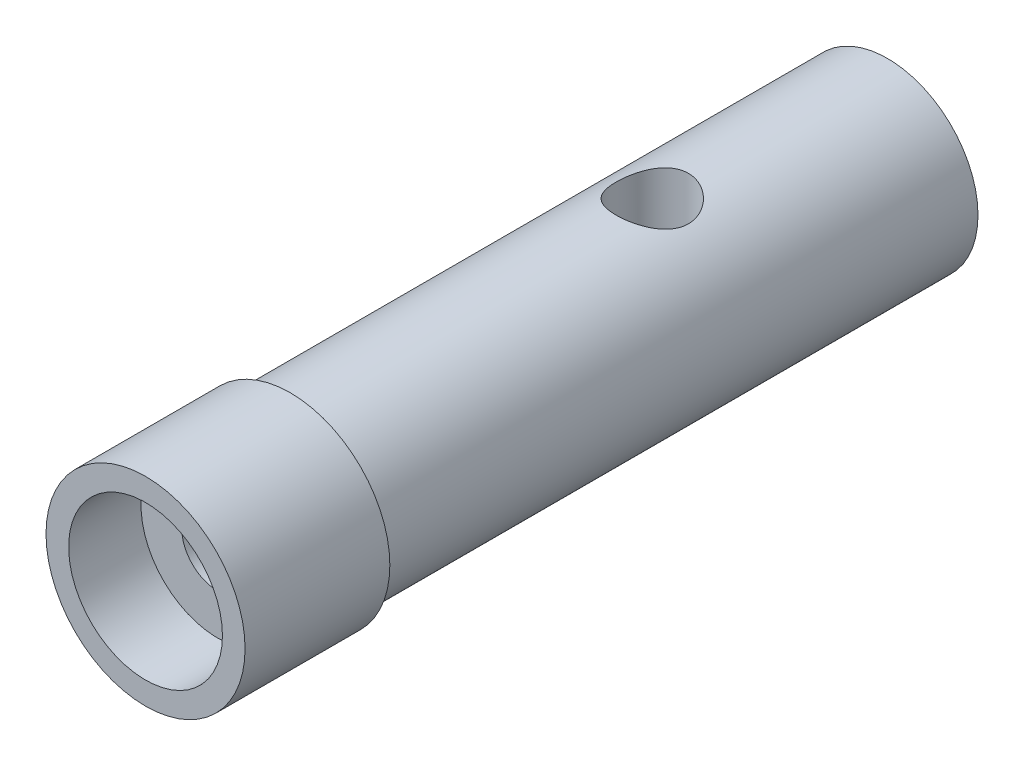
ISO-10303-21;
HEADER;
FILE_DESCRIPTION(('STEP AP214'),'2;1');
FILE_NAME('part.step','',(''),(''),'','','');
FILE_SCHEMA(('AUTOMOTIVE_DESIGN { 1 0 10303 214 1 1 1 1 }'));
ENDSEC;
DATA;
#1=APPLICATION_CONTEXT('core data for automotive mechanical design processes');
#2=APPLICATION_PROTOCOL_DEFINITION('international standard','automotive_design',2000,#1);
#3=PRODUCT_CONTEXT('',#1,'mechanical');
#4=PRODUCT('Part','Part','',(#3));
#5=PRODUCT_RELATED_PRODUCT_CATEGORY('part','',(#4));
#6=PRODUCT_DEFINITION_FORMATION('','',#4);
#7=PRODUCT_DEFINITION_CONTEXT('part definition',#1,'design');
#8=PRODUCT_DEFINITION('design','',#6,#7);
#9=PRODUCT_DEFINITION_SHAPE('','',#8);
#10=(LENGTH_UNIT() NAMED_UNIT(*) SI_UNIT(.MILLI.,.METRE.));
#11=(NAMED_UNIT(*) PLANE_ANGLE_UNIT() SI_UNIT($,.RADIAN.));
#12=(NAMED_UNIT(*) SI_UNIT($,.STERADIAN.) SOLID_ANGLE_UNIT());
#13=UNCERTAINTY_MEASURE_WITH_UNIT(LENGTH_MEASURE(1.E-05),#10,'distance_accuracy_value','');
#14=(GEOMETRIC_REPRESENTATION_CONTEXT(3) GLOBAL_UNCERTAINTY_ASSIGNED_CONTEXT((#13)) GLOBAL_UNIT_ASSIGNED_CONTEXT((#10,
#11,#12)) REPRESENTATION_CONTEXT('',''));
#15=CARTESIAN_POINT('',(0.,0.,0.));
#16=DIRECTION('',(0.,0.,1.));
#17=DIRECTION('',(1.,0.,0.));
#18=AXIS2_PLACEMENT_3D('',#15,#16,#17);
#19=CARTESIAN_POINT('',(5.5,0.,0.));
#20=DIRECTION('',(0.,0.,-1.));
#21=DIRECTION('',(-1.,0.,0.));
#22=AXIS2_PLACEMENT_3D('',#19,#20,#21);
#23=PLANE('',#22);
#24=CARTESIAN_POINT('',(0.,0.,0.));
#25=DIRECTION('',(0.,0.,1.));
#26=DIRECTION('',(1.,0.,0.));
#27=AXIS2_PLACEMENT_3D('',#24,#25,#26);
#28=CIRCLE('',#27,5.5);
#29=CARTESIAN_POINT('',(5.5,0.,0.));
#30=VERTEX_POINT('',#29);
#31=EDGE_CURVE('E42',#30,#30,#28,.T.);
#32=ORIENTED_EDGE('',*,*,#31,.F.);
#33=EDGE_LOOP('',(#32));
#34=FACE_BOUND('',#33,.T.);
#35=CARTESIAN_POINT('',(0.,0.,0.));
#36=DIRECTION('',(0.,0.,-1.));
#37=DIRECTION('',(-1.,0.,0.));
#38=AXIS2_PLACEMENT_3D('',#35,#36,#37);
#39=CIRCLE('',#38,5.);
#40=CARTESIAN_POINT('',(-5.,0.,0.));
#41=VERTEX_POINT('',#40);
#42=EDGE_CURVE('E53',#41,#41,#39,.T.);
#43=ORIENTED_EDGE('',*,*,#42,.F.);
#44=EDGE_LOOP('',(#43));
#45=FACE_BOUND('',#44,.T.);
#46=ADVANCED_FACE('F30',(#34,#45),#23,.T.);
#47=CARTESIAN_POINT('',(0.,0.,0.));
#48=DIRECTION('',(0.,0.,1.));
#49=DIRECTION('',(1.,0.,0.));
#50=AXIS2_PLACEMENT_3D('',#47,#48,#49);
#51=CYLINDRICAL_SURFACE('',#50,5.5);
#52=CARTESIAN_POINT('',(-5.5,0.,2.50000000000001));
#53=CARTESIAN_POINT('',(-5.49999900363929,0.0556786358221872,2.49999784066967));
#54=CARTESIAN_POINT('',(-5.49914576366717,0.111385724959103,2.49533412125869));
#55=CARTESIAN_POINT('',(-5.49582423750998,0.221232203424157,2.47681326698755));
#56=CARTESIAN_POINT('',(-5.4933545536127,0.27537019363304,2.46294817570933));
#57=CARTESIAN_POINT('',(-5.48707661617533,0.380473786256878,2.42646143516452));
#58=CARTESIAN_POINT('',(-5.4832695396596,0.431442131965093,2.40384748390513));
#59=CARTESIAN_POINT('',(-5.47473335749149,0.528856001692258,2.35052633440412));
#60=CARTESIAN_POINT('',(-5.47000433515661,0.575301933839529,2.31981986740591));
#61=CARTESIAN_POINT('',(-5.46008716749916,0.6628822202562,2.25081704517866));
#62=CARTESIAN_POINT('',(-5.45489486298539,0.703958113016737,2.21244707900963));
#63=CARTESIAN_POINT('',(-5.44466747605903,0.779126786705405,2.1293648229551));
#64=CARTESIAN_POINT('',(-5.43963240455629,0.813219083974897,2.08465209415543));
#65=CARTESIAN_POINT('',(-5.43024920104883,0.873693475082395,1.98974363527012));
#66=CARTESIAN_POINT('',(-5.42590643555049,0.900016566327791,1.93950973238482));
#67=CARTESIAN_POINT('',(-5.41845791638451,0.943827734749904,1.83524067483802));
#68=CARTESIAN_POINT('',(-5.41535206268372,0.961316526416387,1.78120582798749));
#69=CARTESIAN_POINT('',(-5.41077076758353,0.986775988556587,1.6714926753217));
#70=CARTESIAN_POINT('',(-5.40927792311172,0.994848332127236,1.61583870414519));
#71=CARTESIAN_POINT('',(-5.40803915716155,1.00156124368345,1.50394779634272));
#72=CARTESIAN_POINT('',(-5.40829308847025,1.00020260648323,1.44771090924198));
#73=CARTESIAN_POINT('',(-5.41050332524589,0.988174672135013,1.33698404293349));
#74=CARTESIAN_POINT('',(-5.41243856407131,0.977620588495374,1.28248106605214));
#75=CARTESIAN_POINT('',(-5.41776030636955,0.947682616700145,1.17603249081641));
#76=CARTESIAN_POINT('',(-5.42114686816159,0.928298373715953,1.1240869953241));
#77=CARTESIAN_POINT('',(-5.42901190776357,0.881136488946489,1.02388860461063));
#78=CARTESIAN_POINT('',(-5.43349645857175,0.85331195185771,0.975658278666931));
#79=CARTESIAN_POINT('',(-5.44304811005858,0.790092516870225,0.884507631527346));
#80=CARTESIAN_POINT('',(-5.44811526641734,0.754696895117933,0.841587818676873));
#81=CARTESIAN_POINT('',(-5.45835320404272,0.676716997091771,0.761610501777805));
#82=CARTESIAN_POINT('',(-5.46352440908233,0.634034086328457,0.724649155781534));
#83=CARTESIAN_POINT('',(-5.47331875218544,0.543022270346664,0.658397433259574));
#84=CARTESIAN_POINT('',(-5.4779418853578,0.494693314749086,0.629107125189357));
#85=CARTESIAN_POINT('',(-5.4861276891267,0.393663799248654,0.579016305107475));
#86=CARTESIAN_POINT('',(-5.48968916279611,0.340958390197751,0.558225365651999));
#87=CARTESIAN_POINT('',(-5.49534102735441,0.232724207231337,0.525818403753136));
#88=CARTESIAN_POINT('',(-5.49743156504548,0.177195715658035,0.514201465713032));
#89=CARTESIAN_POINT('',(-5.49988596689329,0.0657193247892513,0.500605119040426));
#90=CARTESIAN_POINT('',(-5.50027344670572,0.00978800605446796,0.498493888272947));
#91=CARTESIAN_POINT('',(-5.4993431512375,-0.101628619485484,0.503615899090733));
#92=CARTESIAN_POINT('',(-5.49802545454355,-0.157113946726542,0.510848710035858));
#93=CARTESIAN_POINT('',(-5.49384754316226,-0.265648548796381,0.534343874780926));
#94=CARTESIAN_POINT('',(-5.49099865786081,-0.318712648729162,0.5505399345914));
#95=CARTESIAN_POINT('',(-5.48407647561111,-0.421372356878309,0.591430414260958));
#96=CARTESIAN_POINT('',(-5.48000309946218,-0.470967740480479,0.616125383848838));
#97=CARTESIAN_POINT('',(-5.4710248979242,-0.565847623537474,0.673607318901453));
#98=CARTESIAN_POINT('',(-5.466111908073,-0.611082226042447,0.706475343577951));
#99=CARTESIAN_POINT('',(-5.45602144035542,-0.695441069111744,0.779260188335538));
#100=CARTESIAN_POINT('',(-5.45084393939252,-0.734564774871669,0.819177624705961));
#101=CARTESIAN_POINT('',(-5.44073019778821,-0.806088689438408,0.905523440724239));
#102=CARTESIAN_POINT('',(-5.43579776060943,-0.838399183707102,0.952026653262924));
#103=CARTESIAN_POINT('',(-5.4268075504051,-0.894749932760079,1.04987809070324));
#104=CARTESIAN_POINT('',(-5.42274974611769,-0.918790483153986,1.10122614234219));
#105=CARTESIAN_POINT('',(-5.41599772307738,-0.957789726208744,1.20707537484587));
#106=CARTESIAN_POINT('',(-5.41329719008374,-0.972790539309212,1.26156061536902));
#107=CARTESIAN_POINT('',(-5.40955063272695,-0.993415200892781,1.37233149431553));
#108=CARTESIAN_POINT('',(-5.40850443405679,-0.999040037268158,1.42861694242446));
#109=CARTESIAN_POINT('',(-5.40819346941308,-1.00072156831593,1.54049268773182));
#110=CARTESIAN_POINT('',(-5.40890237272057,-0.996919685006175,1.59608083571927));
#111=CARTESIAN_POINT('',(-5.41196354373513,-0.980164234564086,1.70581181900871));
#112=CARTESIAN_POINT('',(-5.41431580298504,-0.967210714528601,1.75995466174714));
#113=CARTESIAN_POINT('',(-5.42038786040456,-0.932577835792395,1.86518809869769));
#114=CARTESIAN_POINT('',(-5.42410539649873,-0.910912905096173,1.91628358011172));
#115=CARTESIAN_POINT('',(-5.43249088757423,-0.859487368324126,2.01413722358237));
#116=CARTESIAN_POINT('',(-5.4371589041147,-0.829726237845046,2.0608951044228));
#117=CARTESIAN_POINT('',(-5.44700162325733,-0.762457718314005,2.14945643729782));
#118=CARTESIAN_POINT('',(-5.45218253915553,-0.724847077765507,2.19118078493539));
#119=CARTESIAN_POINT('',(-5.46241996034325,-0.643163257116829,2.2677735405061));
#120=CARTESIAN_POINT('',(-5.46747643675957,-0.599088593400475,2.30264037019613));
#121=CARTESIAN_POINT('',(-5.47694487148596,-0.505285594823157,2.36480014856175));
#122=CARTESIAN_POINT('',(-5.48135106586716,-0.455512924895255,2.39202709259008));
#123=CARTESIAN_POINT('',(-5.48896630496673,-0.352036952543178,2.43768960803704));
#124=CARTESIAN_POINT('',(-5.49217649292367,-0.29833746274334,2.45613357963917));
#125=CARTESIAN_POINT('',(-5.49637035188244,-0.203720874729207,2.47988771515111));
#126=CARTESIAN_POINT('',(-5.49772390136792,-0.163362713638248,2.48741716648019));
#127=CARTESIAN_POINT('',(-5.49953908216522,-0.0820081710661034,2.49747404689746));
#128=CARTESIAN_POINT('',(-5.50000073389999,-0.0410118042204174,2.5000015905209));
#129=CARTESIAN_POINT('',(-5.5,0.,2.50000000000001));
#130=B_SPLINE_CURVE_WITH_KNOTS('',3,(#52,#53,#54,#55,#56,#57,#58,#59,#60,#61,#62,#63,#64,#65,
#66,#67,#68,#69,#70,#71,#72,#73,#74,#75,#76,#77,#78,#79,#80,#81,#82,#83,#84,#85,#86,#87,#88,#89,
#90,#91,#92,#93,#94,#95,#96,#97,#98,#99,#100,#101,#102,#103,#104,#105,#106,#107,#108,#109,#110,
#111,#112,#113,#114,#115,#116,#117,#118,#119,#120,#121,#122,#123,#124,#125,#126,#127,#128,#129),
.UNSPECIFIED.,.T.,.F.,(4,2,2,2,2,2,2,2,2,2,2,2,2,2,2,2,2,2,2,2,2,2,2,2,2,2,2,2,2,2,2,2,2,2,2,2,
2,2,4),(0.,0.166885945776168,0.333916386036299,0.500800191433378,0.667668922300759,
0.836225072984436,1.0047928933154,1.17460976101827,1.34441289227867,1.51236510586324,
1.68030316512103,1.8461668364545,2.01203717339438,2.17884653230815,2.3456718466063,
2.51496605220939,2.68426176852326,2.85374763511909,3.0232165843073,3.19032800498686,
3.35743172425403,3.52331571642719,3.68921044037115,3.85682113397838,4.02444648808066,
4.19415753065235,4.36386250626243,4.53277050538084,4.70166070651807,4.86803254865192,
5.03440353459662,5.20050010129487,5.36660742888459,5.53505557265026,5.70354243914739,
5.87344302271471,6.0431807824909,6.16610855114787,6.2890335049339),.UNSPECIFIED.);
#131=CARTESIAN_POINT('',(-5.5,0.,2.50000000000001));
#132=VERTEX_POINT('',#131);
#133=EDGE_CURVE('E70',#132,#132,#130,.T.);
#134=ORIENTED_EDGE('',*,*,#133,.F.);
#135=EDGE_LOOP('',(#134));
#136=FACE_BOUND('',#135,.T.);
#137=ORIENTED_EDGE('',*,*,#31,.T.);
#138=EDGE_LOOP('',(#137));
#139=FACE_BOUND('',#138,.T.);
#140=CARTESIAN_POINT('',(0.,0.,8.));
#141=DIRECTION('',(0.,0.,1.));
#142=DIRECTION('',(1.,0.,0.));
#143=AXIS2_PLACEMENT_3D('',#140,#141,#142);
#144=CIRCLE('',#143,5.5);
#145=CARTESIAN_POINT('',(5.5,0.,8.));
#146=VERTEX_POINT('',#145);
#147=EDGE_CURVE('E46',#146,#146,#144,.T.);
#148=ORIENTED_EDGE('',*,*,#147,.F.);
#149=EDGE_LOOP('',(#148));
#150=FACE_BOUND('',#149,.T.);
#151=ADVANCED_FACE('F32',(#136,#139,#150),#51,.T.);
#152=CARTESIAN_POINT('',(0.,0.,8.));
#153=DIRECTION('',(0.,0.,1.));
#154=DIRECTION('',(1.,0.,0.));
#155=AXIS2_PLACEMENT_3D('',#152,#153,#154);
#156=PLANE('',#155);
#157=CARTESIAN_POINT('',(0.,0.,8.));
#158=DIRECTION('',(0.,0.,1.));
#159=DIRECTION('',(1.,0.,0.));
#160=AXIS2_PLACEMENT_3D('',#157,#158,#159);
#161=CIRCLE('',#160,4.24999999999999);
#162=CARTESIAN_POINT('',(4.24999999999999,0.,8.));
#163=VERTEX_POINT('',#162);
#164=EDGE_CURVE('E67',#163,#163,#161,.T.);
#165=ORIENTED_EDGE('',*,*,#164,.F.);
#166=EDGE_LOOP('',(#165));
#167=FACE_BOUND('',#166,.T.);
#168=ORIENTED_EDGE('',*,*,#147,.T.);
#169=EDGE_LOOP('',(#168));
#170=FACE_BOUND('',#169,.T.);
#171=ADVANCED_FACE('F114',(#167,#170),#156,.T.);
#172=CARTESIAN_POINT('',(0.,0.,-33.));
#173=DIRECTION('',(0.,0.,1.));
#174=DIRECTION('',(1.,0.,0.));
#175=AXIS2_PLACEMENT_3D('',#172,#173,#174);
#176=CYLINDRICAL_SURFACE('',#175,5.);
#177=CARTESIAN_POINT('',(0.,5.,-18.));
#178=CARTESIAN_POINT('',(-0.107493005442891,4.99999271227085,-18.0000098518237));
#179=CARTESIAN_POINT('',(-0.215172564090674,4.99649294306932,-18.0087177520884));
#180=CARTESIAN_POINT('',(-0.427496480417896,4.98283453100641,-18.0432477035212));
#181=CARTESIAN_POINT('',(-0.532131777561249,4.97265778698877,-18.0691162790861));
#182=CARTESIAN_POINT('',(-0.734953922727403,4.94674209213118,-18.1368760780588));
#183=CARTESIAN_POINT('',(-0.833160661616959,4.93102136364072,-18.1787148462167));
#184=CARTESIAN_POINT('',(-1.02107197032837,4.89556610796078,-18.2770191733265));
#185=CARTESIAN_POINT('',(-1.11077947675099,4.87583297458057,-18.3334796549189));
#186=CARTESIAN_POINT('',(-1.28350100757039,4.83330886170419,-18.4622354985609));
#187=CARTESIAN_POINT('',(-1.36606227255021,4.8104229692919,-18.5351066562403));
#188=CARTESIAN_POINT('',(-1.51817500478472,4.76460576906194,-18.6934000034768));
#189=CARTESIAN_POINT('',(-1.58772010713353,4.74167444453792,-18.7788282972117));
#190=CARTESIAN_POINT('',(-1.71487456729288,4.69722791797136,-18.9644280702423));
#191=CARTESIAN_POINT('',(-1.77181498119547,4.67582115964951,-19.0650864860232));
#192=CARTESIAN_POINT('',(-1.86775471903715,4.63833647186792,-19.27553639842));
#193=CARTESIAN_POINT('',(-1.90676256428584,4.62225601244176,-19.3853235278484));
#194=CARTESIAN_POINT('',(-1.96389882339587,4.59826357660818,-19.6057123335921));
#195=CARTESIAN_POINT('',(-1.98289396580565,4.59001420355605,-19.7160512355762));
#196=CARTESIAN_POINT('',(-2.00217296164003,4.58164004049144,-19.9386349983073));
#197=CARTESIAN_POINT('',(-2.00246601631322,4.58151125522768,-20.050878894625));
#198=CARTESIAN_POINT('',(-1.98498936750455,4.58910500279994,-20.265756671458));
#199=CARTESIAN_POINT('',(-1.96847531430514,4.5962817503845,-20.368515714409));
#200=CARTESIAN_POINT('',(-1.91994688029782,4.61676187607836,-20.5696595560067));
#201=CARTESIAN_POINT('',(-1.88792979480463,4.63006632321673,-20.6680435881103));
#202=CARTESIAN_POINT('',(-1.80869473255107,4.6615948508853,-20.860017836196));
#203=CARTESIAN_POINT('',(-1.76117986231532,4.67991379280788,-20.9534692390547));
#204=CARTESIAN_POINT('',(-1.65250646073221,4.7193811638989,-21.1314158163616));
#205=CARTESIAN_POINT('',(-1.59134280510085,4.74053065456849,-21.2159076094028));
#206=CARTESIAN_POINT('',(-1.45155059945444,4.78526736742271,-21.380409728802));
#207=CARTESIAN_POINT('',(-1.37193746297064,4.80891664976151,-21.459568729446));
#208=CARTESIAN_POINT('',(-1.20031442743019,4.85459824958282,-21.603684478002));
#209=CARTESIAN_POINT('',(-1.10830206533443,4.87663024445325,-21.6686383974103));
#210=CARTESIAN_POINT('',(-0.912077652605842,4.91714681264548,-21.7836174474158));
#211=CARTESIAN_POINT('',(-0.807660491346477,4.93555270095415,-21.8333222811971));
#212=CARTESIAN_POINT('',(-0.591023765482882,4.96614828328759,-21.9141678610781));
#213=CARTESIAN_POINT('',(-0.478808196849675,4.97834113462382,-21.9453180375574));
#214=CARTESIAN_POINT('',(-0.256895887607821,4.99456139506911,-21.9864482954197));
#215=CARTESIAN_POINT('',(-0.147443293985536,4.99902945833514,-21.9975724542536));
#216=CARTESIAN_POINT('',(0.0718453098078163,5.00068478510631,-22.0017131005286));
#217=CARTESIAN_POINT('',(0.181681213223923,4.99787393582291,-21.9947342815475));
#218=CARTESIAN_POINT('',(0.393432739121987,4.98557567063753,-21.963708247448));
#219=CARTESIAN_POINT('',(0.495482491775474,4.97639391345523,-21.940442019649));
#220=CARTESIAN_POINT('',(0.694135428060781,4.952594414055,-21.8785642916902));
#221=CARTESIAN_POINT('',(0.790737910224845,4.9379759735653,-21.8399508203313));
#222=CARTESIAN_POINT('',(0.979078785816703,4.90416594770812,-21.7472150603201));
#223=CARTESIAN_POINT('',(1.07057802275541,4.88484815979803,-21.6926545279569));
#224=CARTESIAN_POINT('',(1.24344359124656,4.84373364745525,-21.5700596760944));
#225=CARTESIAN_POINT('',(1.32480584076113,4.8219359311027,-21.5020199570774));
#226=CARTESIAN_POINT('',(1.48072304302882,4.77645117638112,-21.3491299870504));
#227=CARTESIAN_POINT('',(1.55447393380607,4.75273441425052,-21.2634664584938));
#228=CARTESIAN_POINT('',(1.68675119741371,4.70741672917132,-21.0805599169906));
#229=CARTESIAN_POINT('',(1.74527506133751,4.68581615526511,-20.9833149996601));
#230=CARTESIAN_POINT('',(1.84580750193163,4.64714299907708,-20.7785383054059));
#231=CARTESIAN_POINT('',(1.88765059453445,4.63011630884788,-20.6709160007877));
#232=CARTESIAN_POINT('',(1.95229621970531,4.60323673477931,-20.4492663482849));
#233=CARTESIAN_POINT('',(1.97511280526932,4.59337855695998,-20.3352437941876));
#234=CARTESIAN_POINT('',(1.9997156172784,4.58271759299926,-20.1128720982255));
#235=CARTESIAN_POINT('',(2.00289708230287,4.58131421008171,-20.0047051604067));
#236=CARTESIAN_POINT('',(1.99180315927753,4.58614836033098,-19.7894551422867));
#237=CARTESIAN_POINT('',(1.97752998791378,4.59238492324793,-19.6823719260974));
#238=CARTESIAN_POINT('',(1.93307136615365,4.6112664907902,-19.476667810145));
#239=CARTESIAN_POINT('',(1.90353749357098,4.62364831827449,-19.377879725567));
#240=CARTESIAN_POINT('',(1.83000544849102,4.65324001232696,-19.1866213703865));
#241=CARTESIAN_POINT('',(1.78600328139382,4.67045121206007,-19.0941528531002));
#242=CARTESIAN_POINT('',(1.68187276275973,4.70898609604491,-18.9123903807292));
#243=CARTESIAN_POINT('',(1.62096533515949,4.73048882313242,-18.8235813298695));
#244=CARTESIAN_POINT('',(1.4858921192715,4.77463804372237,-18.6570066827962));
#245=CARTESIAN_POINT('',(1.41172233481812,4.79728488048406,-18.5792444278717));
#246=CARTESIAN_POINT('',(1.24650550627247,4.84293567087394,-18.4317971467364));
#247=CARTESIAN_POINT('',(1.15467600114614,4.86586757962185,-18.3629626931019));
#248=CARTESIAN_POINT('',(0.959900320285782,4.90800406713717,-18.2416629573784));
#249=CARTESIAN_POINT('',(0.85694900454724,4.92720691092906,-18.1892052878475));
#250=CARTESIAN_POINT('',(0.644738062495204,4.95939714815861,-18.1033777848097));
#251=CARTESIAN_POINT('',(0.535631618219697,4.97249363055028,-18.0696706764397));
#252=CARTESIAN_POINT('',(0.312876546281221,4.99144306209366,-18.0213608790457));
#253=CARTESIAN_POINT('',(0.199243525858913,4.99731899495638,-18.0066975632561));
#254=CARTESIAN_POINT('',(0.0569122978909295,4.99975899504136,-18.0006046190217));
#255=CARTESIAN_POINT('',(0.0284626887407583,5.00000192969176,-17.9999973913708));
#256=CARTESIAN_POINT('',(0.,5.,-18.));
#257=B_SPLINE_CURVE_WITH_KNOTS('',3,(#177,#178,#179,#180,#181,#182,#183,#184,#185,#186,#187,
#188,#189,#190,#191,#192,#193,#194,#195,#196,#197,#198,#199,#200,#201,#202,#203,#204,#205,#206,
#207,#208,#209,#210,#211,#212,#213,#214,#215,#216,#217,#218,#219,#220,#221,#222,#223,#224,#225,
#226,#227,#228,#229,#230,#231,#232,#233,#234,#235,#236,#237,#238,#239,#240,#241,#242,#243,#244,
#245,#246,#247,#248,#249,#250,#251,#252,#253,#254,#255,#256),.UNSPECIFIED.,.T.,.F.,(4,2,2,2,2,2,
2,2,2,2,2,2,2,2,2,2,2,2,2,2,2,2,2,2,2,2,2,2,2,2,2,2,2,2,2,2,2,2,2,4),(0.,0.322402987893071,
0.645683636007935,0.967911457471581,1.29002753567984,1.62597381700397,1.96208394934412,
2.31315258819217,2.66405423118268,2.99904105308829,3.33386306340488,3.64538328401373,
3.95695787256048,4.27489126298816,4.59294421938184,4.93558349186557,5.27829092839734,
5.62776913162807,5.97706956113791,6.30569184528008,6.63422893570083,6.94800455564366,
7.26182048993797,7.58523513398263,7.9087795949897,8.25368474624414,8.59864669043749,
8.94695045140828,9.29499672645935,9.61799673392749,9.94095572563047,10.2511431854877,
10.5614163580516,10.8894546805669,11.2175920134839,11.5670042353384,11.9165786364053,
12.2596430101332,12.6016125240434,12.686980458968),.UNSPECIFIED.);
#258=CARTESIAN_POINT('',(0.,5.,-18.));
#259=VERTEX_POINT('',#258);
#260=EDGE_CURVE('E10',#259,#259,#257,.T.);
#261=ORIENTED_EDGE('',*,*,#260,.T.);
#262=EDGE_LOOP('',(#261));
#263=FACE_BOUND('',#262,.T.);
#264=CARTESIAN_POINT('',(0.,0.,-33.));
#265=DIRECTION('',(0.,0.,-1.));
#266=DIRECTION('',(-1.,0.,0.));
#267=AXIS2_PLACEMENT_3D('',#264,#265,#266);
#268=CIRCLE('',#267,5.);
#269=CARTESIAN_POINT('',(-5.,0.,-33.));
#270=VERTEX_POINT('',#269);
#271=EDGE_CURVE('E50',#270,#270,#268,.T.);
#272=ORIENTED_EDGE('',*,*,#271,.F.);
#273=EDGE_LOOP('',(#272));
#274=FACE_BOUND('',#273,.T.);
#275=ORIENTED_EDGE('',*,*,#42,.T.);
#276=EDGE_LOOP('',(#275));
#277=FACE_BOUND('',#276,.T.);
#278=ADVANCED_FACE('F109',(#263,#274,#277),#176,.T.);
#279=CARTESIAN_POINT('',(0.,0.,-33.));
#280=DIRECTION('',(0.,0.,-1.));
#281=DIRECTION('',(-1.,0.,0.));
#282=AXIS2_PLACEMENT_3D('',#279,#280,#281);
#283=PLANE('',#282);
#284=CARTESIAN_POINT('',(0.,0.,-33.));
#285=DIRECTION('',(0.,0.,-1.));
#286=DIRECTION('',(-1.,0.,0.));
#287=AXIS2_PLACEMENT_3D('',#284,#285,#286);
#288=CIRCLE('',#287,2.);
#289=CARTESIAN_POINT('',(-2.,0.,-33.));
#290=VERTEX_POINT('',#289);
#291=EDGE_CURVE('E137',#290,#290,#288,.T.);
#292=ORIENTED_EDGE('',*,*,#291,.F.);
#293=EDGE_LOOP('',(#292));
#294=FACE_BOUND('',#293,.T.);
#295=ORIENTED_EDGE('',*,*,#271,.T.);
#296=EDGE_LOOP('',(#295));
#297=FACE_BOUND('',#296,.T.);
#298=ADVANCED_FACE('F106',(#294,#297),#283,.T.);
#299=CARTESIAN_POINT('',(0.,0.,-6.));
#300=DIRECTION('',(0.,0.,-1.));
#301=DIRECTION('',(-1.,0.,0.));
#302=AXIS2_PLACEMENT_3D('',#299,#300,#301);
#303=PLANE('',#302);
#304=CARTESIAN_POINT('',(0.,0.,-6.));
#305=DIRECTION('',(0.,0.,1.));
#306=DIRECTION('',(1.,0.,0.));
#307=AXIS2_PLACEMENT_3D('',#304,#305,#306);
#308=CIRCLE('',#307,2.);
#309=CARTESIAN_POINT('',(2.,0.,-6.));
#310=VERTEX_POINT('',#309);
#311=EDGE_CURVE('E56',#310,#310,#308,.T.);
#312=ORIENTED_EDGE('',*,*,#311,.T.);
#313=EDGE_LOOP('',(#312));
#314=FACE_BOUND('',#313,.T.);
#315=ADVANCED_FACE('F102',(#314),#303,.F.);
#316=CARTESIAN_POINT('',(0.,0.,8.));
#317=DIRECTION('',(0.,0.,1.));
#318=DIRECTION('',(1.,0.,0.));
#319=AXIS2_PLACEMENT_3D('',#316,#317,#318);
#320=CYLINDRICAL_SURFACE('',#319,2.);
#321=CARTESIAN_POINT('',(-2.,0.,2.50000000000001));
#322=CARTESIAN_POINT('',(-1.99999713404151,0.052571962952987,2.49999669768051));
#323=CARTESIAN_POINT('',(-1.99790491019517,0.105206599698034,2.49582992687834));
#324=CARTESIAN_POINT('',(-1.98974156037396,0.208920235268427,2.4793471196591));
#325=CARTESIAN_POINT('',(-1.98366287828983,0.259996086713506,2.46701560700236));
#326=CARTESIAN_POINT('',(-1.96816279403311,0.358933544880578,2.43480619138322));
#327=CARTESIAN_POINT('',(-1.9587543917752,0.406806802939184,2.414957615752));
#328=CARTESIAN_POINT('',(-1.93745776515778,0.49847261680657,2.36842937863507));
#329=CARTESIAN_POINT('',(-1.9255697363353,0.542265493990056,2.34175025575116));
#330=CARTESIAN_POINT('',(-1.89956258258056,0.627507817761926,2.28048275051471));
#331=CARTESIAN_POINT('',(-1.88535199127535,0.668655211122119,2.24551352076037));
#332=CARTESIAN_POINT('',(-1.85659970246744,0.744779444866985,2.16947852075298));
#333=CARTESIAN_POINT('',(-1.84205776209034,0.779751583106775,2.12840814822757));
#334=CARTESIAN_POINT('',(-1.81298951197346,0.845252000450288,2.03751665047663));
#335=CARTESIAN_POINT('',(-1.79855186970131,0.875225335551647,1.9872639016541));
#336=CARTESIAN_POINT('',(-1.7728597877232,0.926168226890707,1.88163266401379));
#337=CARTESIAN_POINT('',(-1.76160307606989,0.947144214966345,1.82625787127726));
#338=CARTESIAN_POINT('',(-1.74457867037808,0.978132442188601,1.71533489457808));
#339=CARTESIAN_POINT('',(-1.73852271583713,0.988725857080454,1.65999554793261));
#340=CARTESIAN_POINT('',(-1.73181889948527,1.00042699330886,1.54802116222053));
#341=CARTESIAN_POINT('',(-1.73116569343287,1.00154408837309,1.49138745912885));
#342=CARTESIAN_POINT('',(-1.73510930257247,0.994687287172307,1.38571397568463));
#343=CARTESIAN_POINT('',(-1.73908763662012,0.987784559536835,1.33657596877695));
#344=CARTESIAN_POINT('',(-1.75076228733849,0.966939849056945,1.24027809062696));
#345=CARTESIAN_POINT('',(-1.75845978831775,0.952995623897665,1.19311885469468));
#346=CARTESIAN_POINT('',(-1.7768747641274,0.918209780386017,1.10077086743434));
#347=CARTESIAN_POINT('',(-1.78765840663998,0.897215067116008,1.05565360121421));
#348=CARTESIAN_POINT('',(-1.81103404281403,0.849041687668015,0.969365707409988));
#349=CARTESIAN_POINT('',(-1.8236268478019,0.82186024381248,0.928196864399907));
#350=CARTESIAN_POINT('',(-1.85113157903285,0.758066054912801,0.845478747256769));
#351=CARTESIAN_POINT('',(-1.86613510236745,0.720694458369294,0.804543126423837));
#352=CARTESIAN_POINT('',(-1.89547623300407,0.639555578741385,0.729264581409091));
#353=CARTESIAN_POINT('',(-1.909813519588,0.595785256574297,0.694924807966109));
#354=CARTESIAN_POINT('',(-1.93701987282963,0.500516505831859,0.632314338970264));
#355=CARTESIAN_POINT('',(-1.94978984162007,0.448753591599418,0.60439952755425));
#356=CARTESIAN_POINT('',(-1.97157881121242,0.340466215488805,0.55790297095698));
#357=CARTESIAN_POINT('',(-1.98060078943552,0.283945576265284,0.539313814984821));
#358=CARTESIAN_POINT('',(-1.99324333741436,0.172766491660708,0.513524596283312));
#359=CARTESIAN_POINT('',(-1.99724938301311,0.11834153054833,0.505508764253209));
#360=CARTESIAN_POINT('',(-2.00073013459102,0.00877959994935761,0.498535268865497));
#361=CARTESIAN_POINT('',(-2.00020698721312,-0.0463570198698982,0.499573314360508));
#362=CARTESIAN_POINT('',(-1.99491192253441,-0.151232971985992,0.51020668841874));
#363=CARTESIAN_POINT('',(-1.99047245688189,-0.201059408049953,0.519132532730017));
#364=CARTESIAN_POINT('',(-1.97822171314819,-0.298406892301917,0.544238071895072));
#365=CARTESIAN_POINT('',(-1.97041006334332,-0.345927685690997,0.560418566453345));
#366=CARTESIAN_POINT('',(-1.95184251413669,-0.438888608449667,0.599998466433158));
#367=CARTESIAN_POINT('',(-1.94100881769939,-0.484230397006156,0.623591050116799));
#368=CARTESIAN_POINT('',(-1.91743974317109,-0.570461361698924,0.677107535646028));
#369=CARTESIAN_POINT('',(-1.90470355565785,-0.611348629775286,0.707034134593418));
#370=CARTESIAN_POINT('',(-1.87708221337464,-0.691767689290658,0.77576042533286));
#371=CARTESIAN_POINT('',(-1.86210884848441,-0.730772077824644,0.815142868453552));
#372=CARTESIAN_POINT('',(-1.83262391603874,-0.801856321113246,0.899925151269292));
#373=CARTESIAN_POINT('',(-1.81811267381526,-0.833931385690849,0.945329118816362));
#374=CARTESIAN_POINT('',(-1.79051192226067,-0.891707914497705,1.0436436542003));
#375=CARTESIAN_POINT('',(-1.77752529663471,-0.917025495878647,1.09681126620858));
#376=CARTESIAN_POINT('',(-1.75574072368125,-0.958082826013814,1.20751006769251));
#377=CARTESIAN_POINT('',(-1.74693738240617,-0.973834915887581,1.26503552650118));
#378=CARTESIAN_POINT('',(-1.73561501008666,-0.993861687449691,1.37691022286144));
#379=CARTESIAN_POINT('',(-1.7325738346049,-0.999092996400878,1.43103425342903));
#380=CARTESIAN_POINT('',(-1.73165354646174,-1.0006891543808,1.53944706717072));
#381=CARTESIAN_POINT('',(-1.73377219627552,-0.997057846624412,1.59373576873943));
#382=CARTESIAN_POINT('',(-1.74237862050024,-0.981926125592277,1.69548350153201));
#383=CARTESIAN_POINT('',(-1.74843094482393,-0.971208314342813,1.7431004701444));
#384=CARTESIAN_POINT('',(-1.76371016187916,-0.943175358224659,1.8358081194247));
#385=CARTESIAN_POINT('',(-1.77293807569675,-0.925858091159825,1.88089798209197));
#386=CARTESIAN_POINT('',(-1.79428530364527,-0.883815745300698,1.97062485098661));
#387=CARTESIAN_POINT('',(-1.8065572239619,-0.858671137816473,2.0150279018297));
#388=CARTESIAN_POINT('',(-1.83235331634589,-0.802150971636649,2.09927453618059));
#389=CARTESIAN_POINT('',(-1.84587813794521,-0.770772171238663,2.13911573051849));
#390=CARTESIAN_POINT('',(-1.87462323159312,-0.698203326664656,2.21814198235762));
#391=CARTESIAN_POINT('',(-1.88984983311468,-0.656284423010186,2.25665910236193));
#392=CARTESIAN_POINT('',(-1.91877752255087,-0.566154806220294,2.32626298342364));
#393=CARTESIAN_POINT('',(-1.93247778608039,-0.517940723256799,2.3573457394263));
#394=CARTESIAN_POINT('',(-1.95698009585103,-0.41593159681996,2.41123636276221));
#395=CARTESIAN_POINT('',(-1.96776096562908,-0.362099503934627,2.43398416941144));
#396=CARTESIAN_POINT('',(-1.98501341363465,-0.250742101294202,2.46980816791896));
#397=CARTESIAN_POINT('',(-1.99149723372932,-0.193227799623176,2.48291184682959));
#398=CARTESIAN_POINT('',(-1.99695461909663,-0.112601946483391,2.49389741107586));
#399=CARTESIAN_POINT('',(-1.99809365339201,-0.0901618794395047,2.49618264086363));
#400=CARTESIAN_POINT('',(-1.99961696977865,-0.0451517318071607,2.49923466551682));
#401=CARTESIAN_POINT('',(-2.00000123103763,-0.0225816476473829,2.50000141847121));
#402=CARTESIAN_POINT('',(-2.,0.,2.50000000000001));
#403=B_SPLINE_CURVE_WITH_KNOTS('',3,(#321,#322,#323,#324,#325,#326,#327,#328,#329,#330,#331,
#332,#333,#334,#335,#336,#337,#338,#339,#340,#341,#342,#343,#344,#345,#346,#347,#348,#349,#350,
#351,#352,#353,#354,#355,#356,#357,#358,#359,#360,#361,#362,#363,#364,#365,#366,#367,#368,#369,
#370,#371,#372,#373,#374,#375,#376,#377,#378,#379,#380,#381,#382,#383,#384,#385,#386,#387,#388,
#389,#390,#391,#392,#393,#394,#395,#396,#397,#398,#399,#400,#401,#402),.UNSPECIFIED.,.T.,.F.,(4,
2,2,2,2,2,2,2,2,2,2,2,2,2,2,2,2,2,2,2,2,2,2,2,2,2,2,2,2,2,2,2,2,2,2,2,2,2,2,2,4),(0.,
0.157624257420294,0.315548149709201,0.472862155492303,0.630163760581574,0.796981758718097,
0.963926237654046,1.14381726430754,1.32357947898283,1.49258012140231,1.66141357329022,
1.81005712409323,1.95874803925681,2.1109024016849,2.26312521260224,2.43464941333881,
2.60625534598689,2.78583022214444,2.96526216912283,3.12983290471349,3.2943256451148,
3.44606906506126,3.59782921630936,3.75392856027903,3.91009450748344,4.08159610644424,
4.25321588615437,4.43314682159679,4.61284511940783,4.77529307498379,4.93767059860012,
5.08457930244189,5.23153528783684,5.38836456775621,5.54527561138964,5.72125242752505,
5.8973238337658,6.07464013662932,6.25144908624938,6.31915280137706,6.38685838514855),.UNSPECIFIED.);
#404=CARTESIAN_POINT('',(-2.,0.,2.50000000000001));
#405=VERTEX_POINT('',#404);
#406=EDGE_CURVE('E76',#405,#405,#403,.T.);
#407=ORIENTED_EDGE('',*,*,#406,.T.);
#408=EDGE_LOOP('',(#407));
#409=FACE_BOUND('',#408,.T.);
#410=ORIENTED_EDGE('',*,*,#311,.F.);
#411=EDGE_LOOP('',(#410));
#412=FACE_BOUND('',#411,.T.);
#413=CARTESIAN_POINT('',(0.,0.,4.));
#414=DIRECTION('',(0.,0.,1.));
#415=DIRECTION('',(1.,0.,0.));
#416=AXIS2_PLACEMENT_3D('',#413,#414,#415);
#417=CIRCLE('',#416,2.);
#418=CARTESIAN_POINT('',(2.,0.,4.));
#419=VERTEX_POINT('',#418);
#420=EDGE_CURVE('E61',#419,#419,#417,.T.);
#421=ORIENTED_EDGE('',*,*,#420,.T.);
#422=EDGE_LOOP('',(#421));
#423=FACE_BOUND('',#422,.T.);
#424=ADVANCED_FACE('F98',(#409,#412,#423),#320,.F.);
#425=CARTESIAN_POINT('',(2.,0.,4.));
#426=DIRECTION('',(0.,0.,-1.));
#427=DIRECTION('',(-1.,0.,0.));
#428=AXIS2_PLACEMENT_3D('',#425,#426,#427);
#429=PLANE('',#428);
#430=ORIENTED_EDGE('',*,*,#420,.F.);
#431=EDGE_LOOP('',(#430));
#432=FACE_BOUND('',#431,.T.);
#433=CARTESIAN_POINT('',(0.,0.,4.));
#434=DIRECTION('',(0.,0.,1.));
#435=DIRECTION('',(1.,0.,0.));
#436=AXIS2_PLACEMENT_3D('',#433,#434,#435);
#437=CIRCLE('',#436,4.25);
#438=CARTESIAN_POINT('',(4.25,0.,4.));
#439=VERTEX_POINT('',#438);
#440=EDGE_CURVE('E64',#439,#439,#437,.T.);
#441=ORIENTED_EDGE('',*,*,#440,.T.);
#442=EDGE_LOOP('',(#441));
#443=FACE_BOUND('',#442,.T.);
#444=ADVANCED_FACE('F94',(#432,#443),#429,.F.);
#445=CARTESIAN_POINT('',(0.,0.,8.));
#446=DIRECTION('',(0.,0.,1.));
#447=DIRECTION('',(1.,0.,0.));
#448=AXIS2_PLACEMENT_3D('',#445,#446,#447);
#449=CYLINDRICAL_SURFACE('',#448,4.25);
#450=ORIENTED_EDGE('',*,*,#440,.F.);
#451=EDGE_LOOP('',(#450));
#452=FACE_BOUND('',#451,.T.);
#453=ORIENTED_EDGE('',*,*,#164,.T.);
#454=EDGE_LOOP('',(#453));
#455=FACE_BOUND('',#454,.T.);
#456=ADVANCED_FACE('F86',(#452,#455),#449,.F.);
#457=CARTESIAN_POINT('',(-5.5,0.,1.5));
#458=DIRECTION('',(-1.,0.,0.));
#459=DIRECTION('',(0.,0.,1.));
#460=AXIS2_PLACEMENT_3D('',#457,#458,#459);
#461=CYLINDRICAL_SURFACE('',#460,1.00000000000001);
#462=ORIENTED_EDGE('',*,*,#133,.T.);
#463=EDGE_LOOP('',(#462));
#464=FACE_BOUND('',#463,.T.);
#465=ORIENTED_EDGE('',*,*,#406,.F.);
#466=EDGE_LOOP('',(#465));
#467=FACE_BOUND('',#466,.T.);
#468=ADVANCED_FACE('F81',(#464,#467),#461,.F.);
#469=CARTESIAN_POINT('',(0.,0.,-23.));
#470=DIRECTION('',(0.,0.,-1.));
#471=DIRECTION('',(-1.,0.,0.));
#472=AXIS2_PLACEMENT_3D('',#469,#470,#471);
#473=CYLINDRICAL_SURFACE('',#472,2.);
#474=CARTESIAN_POINT('',(0.,0.,-23.));
#475=DIRECTION('',(0.,0.,-1.));
#476=DIRECTION('',(-1.,0.,0.));
#477=AXIS2_PLACEMENT_3D('',#474,#475,#476);
#478=CIRCLE('',#477,2.);
#479=CARTESIAN_POINT('',(-2.,0.,-23.));
#480=VERTEX_POINT('',#479);
#481=EDGE_CURVE('E135',#480,#480,#478,.T.);
#482=ORIENTED_EDGE('',*,*,#481,.F.);
#483=EDGE_LOOP('',(#482));
#484=FACE_BOUND('',#483,.T.);
#485=ORIENTED_EDGE('',*,*,#291,.T.);
#486=EDGE_LOOP('',(#485));
#487=FACE_BOUND('',#486,.T.);
#488=ADVANCED_FACE('F85',(#484,#487),#473,.F.);
#489=CARTESIAN_POINT('',(0.,0.,-23.));
#490=DIRECTION('',(0.,0.,-1.));
#491=DIRECTION('',(-1.,0.,0.));
#492=AXIS2_PLACEMENT_3D('',#489,#490,#491);
#493=PLANE('',#492);
#494=ORIENTED_EDGE('',*,*,#481,.T.);
#495=EDGE_LOOP('',(#494));
#496=FACE_BOUND('',#495,.T.);
#497=ADVANCED_FACE('F152',(#496),#493,.T.);
#498=CARTESIAN_POINT('',(0.,0.,-20.));
#499=DIRECTION('',(0.,1.,0.));
#500=DIRECTION('',(0.,0.,1.));
#501=AXIS2_PLACEMENT_3D('',#498,#499,#500);
#502=CYLINDRICAL_SURFACE('',#501,2.);
#503=CARTESIAN_POINT('',(0.,0.,-20.));
#504=DIRECTION('',(0.,1.,0.));
#505=DIRECTION('',(0.,0.,1.));
#506=AXIS2_PLACEMENT_3D('',#503,#504,#505);
#507=CIRCLE('',#506,2.);
#508=CARTESIAN_POINT('',(0.,0.,-18.));
#509=VERTEX_POINT('',#508);
#510=EDGE_CURVE('E142',#509,#509,#507,.T.);
#511=ORIENTED_EDGE('',*,*,#510,.F.);
#512=EDGE_LOOP('',(#511));
#513=FACE_BOUND('',#512,.T.);
#514=ORIENTED_EDGE('',*,*,#260,.F.);
#515=EDGE_LOOP('',(#514));
#516=FACE_BOUND('',#515,.T.);
#517=ADVANCED_FACE('F149',(#513,#516),#502,.F.);
#518=CARTESIAN_POINT('',(0.,0.,-20.));
#519=DIRECTION('',(0.,1.,0.));
#520=DIRECTION('',(0.,0.,1.));
#521=AXIS2_PLACEMENT_3D('',#518,#519,#520);
#522=PLANE('',#521);
#523=ORIENTED_EDGE('',*,*,#510,.T.);
#524=EDGE_LOOP('',(#523));
#525=FACE_BOUND('',#524,.T.);
#526=ADVANCED_FACE('F147',(#525),#522,.T.);
#527=CLOSED_SHELL('',(#46,#151,#171,#278,#298,#315,#424,#444,#456,#468,#488,#497,#517,#526));
#528=MANIFOLD_SOLID_BREP('B2',#527);
#529=ADVANCED_BREP_SHAPE_REPRESENTATION('',(#18,#528),#14);
#530=SHAPE_DEFINITION_REPRESENTATION(#9,#529);
ENDSEC;
END-ISO-10303-21;
